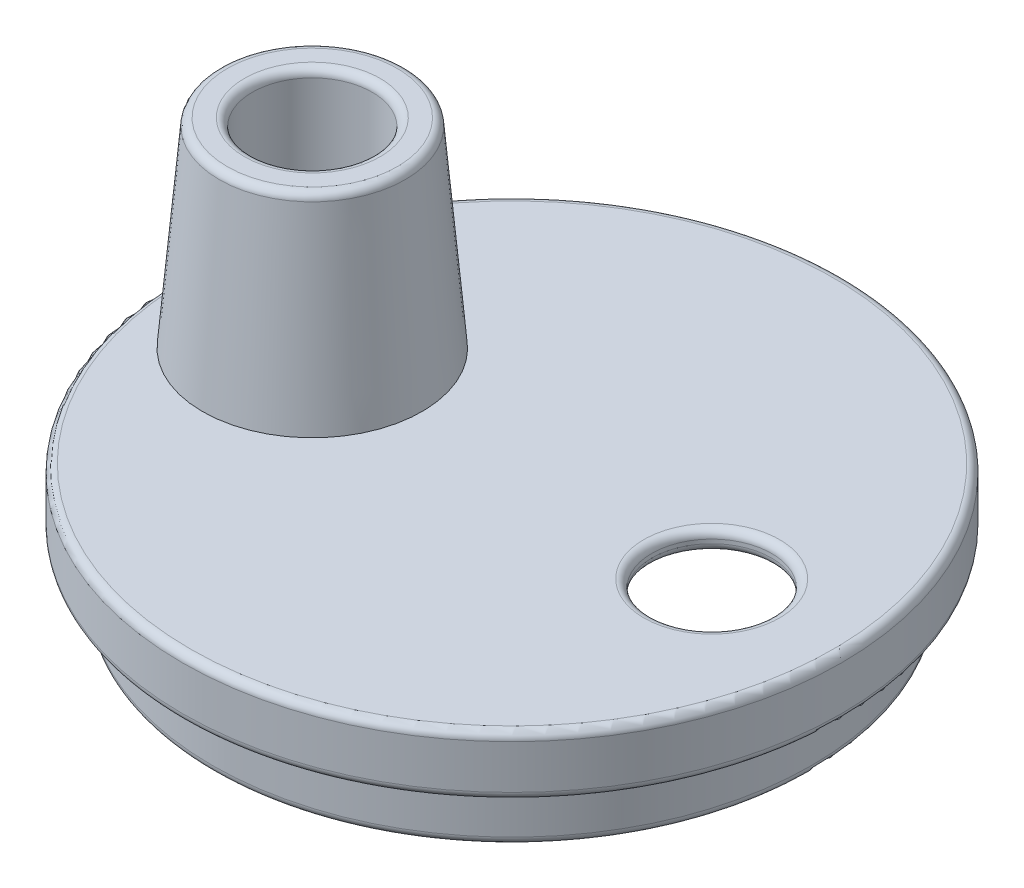
ISO-10303-21;
HEADER;
FILE_DESCRIPTION(('STEP AP214'),'2;1');
FILE_NAME('part.step','',(''),(''),'','','');
FILE_SCHEMA(('AUTOMOTIVE_DESIGN { 1 0 10303 214 1 1 1 1 }'));
ENDSEC;
DATA;
#1=APPLICATION_CONTEXT('core data for automotive mechanical design processes');
#2=APPLICATION_PROTOCOL_DEFINITION('international standard','automotive_design',2000,#1);
#3=PRODUCT_CONTEXT('',#1,'mechanical');
#4=PRODUCT('Part','Part','',(#3));
#5=PRODUCT_RELATED_PRODUCT_CATEGORY('part','',(#4));
#6=PRODUCT_DEFINITION_FORMATION('','',#4);
#7=PRODUCT_DEFINITION_CONTEXT('part definition',#1,'design');
#8=PRODUCT_DEFINITION('design','',#6,#7);
#9=PRODUCT_DEFINITION_SHAPE('','',#8);
#10=(LENGTH_UNIT() NAMED_UNIT(*) SI_UNIT(.MILLI.,.METRE.));
#11=(NAMED_UNIT(*) PLANE_ANGLE_UNIT() SI_UNIT($,.RADIAN.));
#12=(NAMED_UNIT(*) SI_UNIT($,.STERADIAN.) SOLID_ANGLE_UNIT());
#13=UNCERTAINTY_MEASURE_WITH_UNIT(LENGTH_MEASURE(1.E-05),#10,'distance_accuracy_value','');
#14=(GEOMETRIC_REPRESENTATION_CONTEXT(3) GLOBAL_UNCERTAINTY_ASSIGNED_CONTEXT((#13)) GLOBAL_UNIT_ASSIGNED_CONTEXT((#10,
#11,#12)) REPRESENTATION_CONTEXT('',''));
#15=CARTESIAN_POINT('',(0.,0.,0.));
#16=DIRECTION('',(0.,0.,1.));
#17=DIRECTION('',(1.,0.,0.));
#18=AXIS2_PLACEMENT_3D('',#15,#16,#17);
#19=CARTESIAN_POINT('',(0.,0.,0.));
#20=DIRECTION('',(0.,1.,0.));
#21=DIRECTION('',(0.,0.,1.));
#22=AXIS2_PLACEMENT_3D('',#19,#20,#21);
#23=PLANE('',#22);
#24=CARTESIAN_POINT('',(5.,0.,0.));
#25=DIRECTION('',(0.,1.,0.));
#26=DIRECTION('',(0.,0.,1.));
#27=AXIS2_PLACEMENT_3D('',#24,#25,#26);
#28=CIRCLE('',#27,1.7);
#29=CARTESIAN_POINT('',(5.,0.,1.7));
#30=VERTEX_POINT('',#29);
#31=EDGE_CURVE('E47',#30,#30,#28,.F.);
#32=ORIENTED_EDGE('',*,*,#31,.T.);
#33=EDGE_LOOP('',(#32));
#34=FACE_BOUND('',#33,.T.);
#35=CARTESIAN_POINT('',(0.,0.,0.));
#36=DIRECTION('',(0.,1.,0.));
#37=DIRECTION('',(0.,0.,1.));
#38=AXIS2_PLACEMENT_3D('',#35,#36,#37);
#39=CIRCLE('',#38,8.05);
#40=CARTESIAN_POINT('',(0.,0.,8.05));
#41=VERTEX_POINT('',#40);
#42=EDGE_CURVE('E52',#41,#41,#39,.T.);
#43=ORIENTED_EDGE('',*,*,#42,.T.);
#44=EDGE_LOOP('',(#43));
#45=FACE_BOUND('',#44,.T.);
#46=CARTESIAN_POINT('',(-5.,0.,0.));
#47=DIRECTION('',(0.,1.,0.));
#48=DIRECTION('',(0.,0.,1.));
#49=AXIS2_PLACEMENT_3D('',#46,#47,#48);
#50=CIRCLE('',#49,2.75);
#51=CARTESIAN_POINT('',(-5.,0.,2.75));
#52=VERTEX_POINT('',#51);
#53=EDGE_CURVE('E106',#52,#52,#50,.T.);
#54=ORIENTED_EDGE('',*,*,#53,.F.);
#55=EDGE_LOOP('',(#54));
#56=FACE_BOUND('',#55,.T.);
#57=ADVANCED_FACE('F32',(#34,#45,#56),#23,.T.);
#58=CARTESIAN_POINT('',(0.,0.,0.));
#59=DIRECTION('',(0.,1.,0.));
#60=DIRECTION('',(0.,0.,1.));
#61=AXIS2_PLACEMENT_3D('',#58,#59,#60);
#62=CYLINDRICAL_SURFACE('',#61,8.25);
#63=CARTESIAN_POINT('',(0.,-1.3,0.));
#64=DIRECTION('',(0.,-1.,0.));
#65=DIRECTION('',(0.,0.,-1.));
#66=AXIS2_PLACEMENT_3D('',#63,#64,#65);
#67=CIRCLE('',#66,8.25);
#68=CARTESIAN_POINT('',(0.,-1.3,-8.25));
#69=VERTEX_POINT('',#68);
#70=EDGE_CURVE('E64',#69,#69,#67,.F.);
#71=ORIENTED_EDGE('',*,*,#70,.T.);
#72=EDGE_LOOP('',(#71));
#73=FACE_BOUND('',#72,.T.);
#74=CARTESIAN_POINT('',(0.,-0.2,0.));
#75=DIRECTION('',(0.,1.,0.));
#76=DIRECTION('',(0.,0.,1.));
#77=AXIS2_PLACEMENT_3D('',#74,#75,#76);
#78=CIRCLE('',#77,8.25);
#79=CARTESIAN_POINT('',(0.,-0.200000000000001,8.25));
#80=VERTEX_POINT('',#79);
#81=EDGE_CURVE('E67',#80,#80,#78,.F.);
#82=ORIENTED_EDGE('',*,*,#81,.T.);
#83=EDGE_LOOP('',(#82));
#84=FACE_BOUND('',#83,.T.);
#85=ADVANCED_FACE('F113',(#73,#84),#62,.T.);
#86=CARTESIAN_POINT('',(0.,-1.5,8.25));
#87=DIRECTION('',(0.,-1.,0.));
#88=DIRECTION('',(0.,0.,-1.));
#89=AXIS2_PLACEMENT_3D('',#86,#87,#88);
#90=PLANE('',#89);
#91=CARTESIAN_POINT('',(0.,-1.5,0.));
#92=DIRECTION('',(0.,-1.,0.));
#93=DIRECTION('',(0.,0.,-1.));
#94=AXIS2_PLACEMENT_3D('',#91,#92,#93);
#95=CIRCLE('',#94,8.05);
#96=CARTESIAN_POINT('',(0.,-1.5,-8.05));
#97=VERTEX_POINT('',#96);
#98=EDGE_CURVE('E61',#97,#97,#95,.T.);
#99=ORIENTED_EDGE('',*,*,#98,.T.);
#100=EDGE_LOOP('',(#99));
#101=FACE_BOUND('',#100,.T.);
#102=CARTESIAN_POINT('',(0.,-1.5,0.));
#103=DIRECTION('',(0.,1.,0.));
#104=DIRECTION('',(0.,0.,1.));
#105=AXIS2_PLACEMENT_3D('',#102,#103,#104);
#106=CIRCLE('',#105,7.5);
#107=CARTESIAN_POINT('',(0.,-1.5,7.5));
#108=VERTEX_POINT('',#107);
#109=EDGE_CURVE('E94',#108,#108,#106,.T.);
#110=ORIENTED_EDGE('',*,*,#109,.T.);
#111=EDGE_LOOP('',(#110));
#112=FACE_BOUND('',#111,.T.);
#113=ADVANCED_FACE('F119',(#101,#112),#90,.T.);
#114=CARTESIAN_POINT('',(0.,0.,0.));
#115=DIRECTION('',(0.,1.,0.));
#116=DIRECTION('',(0.,0.,1.));
#117=AXIS2_PLACEMENT_3D('',#114,#115,#116);
#118=CYLINDRICAL_SURFACE('',#117,7.5);
#119=CARTESIAN_POINT('',(0.,-2.8,0.));
#120=DIRECTION('',(0.,-1.,0.));
#121=DIRECTION('',(0.,0.,-1.));
#122=AXIS2_PLACEMENT_3D('',#119,#120,#121);
#123=CIRCLE('',#122,7.5);
#124=CARTESIAN_POINT('',(0.,-2.8,-7.5));
#125=VERTEX_POINT('',#124);
#126=EDGE_CURVE('E70',#125,#125,#123,.F.);
#127=ORIENTED_EDGE('',*,*,#126,.T.);
#128=EDGE_LOOP('',(#127));
#129=FACE_BOUND('',#128,.T.);
#130=ORIENTED_EDGE('',*,*,#109,.F.);
#131=EDGE_LOOP('',(#130));
#132=FACE_BOUND('',#131,.T.);
#133=ADVANCED_FACE('F198',(#129,#132),#118,.T.);
#134=CARTESIAN_POINT('',(0.,-3.,7.));
#135=DIRECTION('',(0.,-1.,0.));
#136=DIRECTION('',(0.,0.,-1.));
#137=AXIS2_PLACEMENT_3D('',#134,#135,#136);
#138=PLANE('',#137);
#139=CARTESIAN_POINT('',(0.,-3.,0.));
#140=DIRECTION('',(0.,-1.,0.));
#141=DIRECTION('',(0.,0.,-1.));
#142=AXIS2_PLACEMENT_3D('',#139,#140,#141);
#143=CIRCLE('',#142,7.2);
#144=CARTESIAN_POINT('',(0.,-3.,-7.2));
#145=VERTEX_POINT('',#144);
#146=EDGE_CURVE('E76',#145,#145,#143,.F.);
#147=ORIENTED_EDGE('',*,*,#146,.T.);
#148=EDGE_LOOP('',(#147));
#149=FACE_BOUND('',#148,.T.);
#150=CARTESIAN_POINT('',(0.,-3.,0.));
#151=DIRECTION('',(0.,-1.,0.));
#152=DIRECTION('',(0.,0.,-1.));
#153=AXIS2_PLACEMENT_3D('',#150,#151,#152);
#154=CIRCLE('',#153,7.3);
#155=CARTESIAN_POINT('',(0.,-3.,-7.3));
#156=VERTEX_POINT('',#155);
#157=EDGE_CURVE('E79',#156,#156,#154,.T.);
#158=ORIENTED_EDGE('',*,*,#157,.T.);
#159=EDGE_LOOP('',(#158));
#160=FACE_BOUND('',#159,.T.);
#161=ADVANCED_FACE('F194',(#149,#160),#138,.T.);
#162=CARTESIAN_POINT('',(0.,0.,0.));
#163=DIRECTION('',(0.,1.,0.));
#164=DIRECTION('',(0.,0.,1.));
#165=AXIS2_PLACEMENT_3D('',#162,#163,#164);
#166=CYLINDRICAL_SURFACE('',#165,7.);
#167=CARTESIAN_POINT('',(0.,-2.8,0.));
#168=DIRECTION('',(0.,-1.,0.));
#169=DIRECTION('',(0.,0.,-1.));
#170=AXIS2_PLACEMENT_3D('',#167,#168,#169);
#171=CIRCLE('',#170,7.);
#172=CARTESIAN_POINT('',(0.,-2.8,-7.));
#173=VERTEX_POINT('',#172);
#174=EDGE_CURVE('E73',#173,#173,#171,.T.);
#175=ORIENTED_EDGE('',*,*,#174,.T.);
#176=EDGE_LOOP('',(#175));
#177=FACE_BOUND('',#176,.T.);
#178=CARTESIAN_POINT('',(0.,-1.,0.));
#179=DIRECTION('',(0.,1.,0.));
#180=DIRECTION('',(0.,0.,1.));
#181=AXIS2_PLACEMENT_3D('',#178,#179,#180);
#182=CIRCLE('',#181,7.);
#183=CARTESIAN_POINT('',(0.,-1.,7.));
#184=VERTEX_POINT('',#183);
#185=EDGE_CURVE('E97',#184,#184,#182,.T.);
#186=ORIENTED_EDGE('',*,*,#185,.T.);
#187=EDGE_LOOP('',(#186));
#188=FACE_BOUND('',#187,.T.);
#189=ADVANCED_FACE('F190',(#177,#188),#166,.F.);
#190=CARTESIAN_POINT('',(0.,-1.,7.75));
#191=DIRECTION('',(0.,1.,0.));
#192=DIRECTION('',(0.,0.,1.));
#193=AXIS2_PLACEMENT_3D('',#190,#191,#192);
#194=PLANE('',#193);
#195=CARTESIAN_POINT('',(0.,-1.,0.));
#196=DIRECTION('',(0.,1.,0.));
#197=DIRECTION('',(0.,0.,1.));
#198=AXIS2_PLACEMENT_3D('',#195,#196,#197);
#199=CIRCLE('',#198,7.75);
#200=CARTESIAN_POINT('',(0.,-1.,7.75));
#201=VERTEX_POINT('',#200);
#202=EDGE_CURVE('E100',#201,#201,#199,.T.);
#203=ORIENTED_EDGE('',*,*,#202,.T.);
#204=EDGE_LOOP('',(#203));
#205=FACE_BOUND('',#204,.T.);
#206=ORIENTED_EDGE('',*,*,#185,.F.);
#207=EDGE_LOOP('',(#206));
#208=FACE_BOUND('',#207,.T.);
#209=ADVANCED_FACE('F186',(#205,#208),#194,.T.);
#210=CARTESIAN_POINT('',(0.,0.,0.));
#211=DIRECTION('',(0.,1.,0.));
#212=DIRECTION('',(0.,0.,1.));
#213=AXIS2_PLACEMENT_3D('',#210,#211,#212);
#214=CYLINDRICAL_SURFACE('',#213,7.75);
#215=CARTESIAN_POINT('',(0.,-0.5,0.));
#216=DIRECTION('',(0.,1.,0.));
#217=DIRECTION('',(0.,0.,1.));
#218=AXIS2_PLACEMENT_3D('',#215,#216,#217);
#219=CIRCLE('',#218,7.75);
#220=CARTESIAN_POINT('',(0.,-0.500000000000001,7.75));
#221=VERTEX_POINT('',#220);
#222=EDGE_CURVE('E103',#221,#221,#219,.T.);
#223=ORIENTED_EDGE('',*,*,#222,.T.);
#224=EDGE_LOOP('',(#223));
#225=FACE_BOUND('',#224,.T.);
#226=ORIENTED_EDGE('',*,*,#202,.F.);
#227=EDGE_LOOP('',(#226));
#228=FACE_BOUND('',#227,.T.);
#229=ADVANCED_FACE('F182',(#225,#228),#214,.F.);
#230=CARTESIAN_POINT('',(0.,-0.5,0.));
#231=DIRECTION('',(0.,-1.,0.));
#232=DIRECTION('',(0.,0.,-1.));
#233=AXIS2_PLACEMENT_3D('',#230,#231,#232);
#234=PLANE('',#233);
#235=CARTESIAN_POINT('',(-5.,-0.5,0.));
#236=DIRECTION('',(0.,-1.,0.));
#237=DIRECTION('',(0.,0.,-1.));
#238=AXIS2_PLACEMENT_3D('',#235,#236,#237);
#239=CIRCLE('',#238,1.7);
#240=CARTESIAN_POINT('',(-5.,-0.5,-1.7));
#241=VERTEX_POINT('',#240);
#242=EDGE_CURVE('E88',#241,#241,#239,.F.);
#243=ORIENTED_EDGE('',*,*,#242,.T.);
#244=EDGE_LOOP('',(#243));
#245=FACE_BOUND('',#244,.T.);
#246=CARTESIAN_POINT('',(5.,-0.5,0.));
#247=DIRECTION('',(0.,-1.,0.));
#248=DIRECTION('',(0.,0.,-1.));
#249=AXIS2_PLACEMENT_3D('',#246,#247,#248);
#250=CIRCLE('',#249,1.7);
#251=CARTESIAN_POINT('',(5.,-0.5,-1.7));
#252=VERTEX_POINT('',#251);
#253=EDGE_CURVE('E91',#252,#252,#250,.F.);
#254=ORIENTED_EDGE('',*,*,#253,.T.);
#255=EDGE_LOOP('',(#254));
#256=FACE_BOUND('',#255,.T.);
#257=ORIENTED_EDGE('',*,*,#222,.F.);
#258=EDGE_LOOP('',(#257));
#259=FACE_BOUND('',#258,.T.);
#260=ADVANCED_FACE('F176',(#245,#256,#259),#234,.T.);
#261=CARTESIAN_POINT('',(5.,-3.001,0.));
#262=DIRECTION('',(0.,1.,0.));
#263=DIRECTION('',(0.,0.,1.));
#264=AXIS2_PLACEMENT_3D('',#261,#262,#263);
#265=CYLINDRICAL_SURFACE('',#264,1.5);
#266=CARTESIAN_POINT('',(5.,-0.299999999999999,0.));
#267=DIRECTION('',(0.,-1.,0.));
#268=DIRECTION('',(0.,0.,-1.));
#269=AXIS2_PLACEMENT_3D('',#266,#267,#268);
#270=CIRCLE('',#269,1.5);
#271=CARTESIAN_POINT('',(5.,-0.299999999999999,-1.5));
#272=VERTEX_POINT('',#271);
#273=EDGE_CURVE('E55',#272,#272,#270,.T.);
#274=ORIENTED_EDGE('',*,*,#273,.T.);
#275=EDGE_LOOP('',(#274));
#276=FACE_BOUND('',#275,.T.);
#277=CARTESIAN_POINT('',(5.,-0.2,0.));
#278=DIRECTION('',(0.,1.,0.));
#279=DIRECTION('',(0.,0.,1.));
#280=AXIS2_PLACEMENT_3D('',#277,#278,#279);
#281=CIRCLE('',#280,1.5);
#282=CARTESIAN_POINT('',(5.,-0.2,1.5));
#283=VERTEX_POINT('',#282);
#284=EDGE_CURVE('E58',#283,#283,#281,.T.);
#285=ORIENTED_EDGE('',*,*,#284,.T.);
#286=EDGE_LOOP('',(#285));
#287=FACE_BOUND('',#286,.T.);
#288=ADVANCED_FACE('F168',(#276,#287),#265,.F.);
#289=CARTESIAN_POINT('',(-5.,-3.001,0.));
#290=DIRECTION('',(0.,1.,0.));
#291=DIRECTION('',(0.,0.,1.));
#292=AXIS2_PLACEMENT_3D('',#289,#290,#291);
#293=CYLINDRICAL_SURFACE('',#292,1.5);
#294=CARTESIAN_POINT('',(-5.,-0.299999999999999,0.));
#295=DIRECTION('',(0.,-1.,0.));
#296=DIRECTION('',(0.,0.,-1.));
#297=AXIS2_PLACEMENT_3D('',#294,#295,#296);
#298=CIRCLE('',#297,1.5);
#299=CARTESIAN_POINT('',(-5.,-0.299999999999999,-1.5));
#300=VERTEX_POINT('',#299);
#301=EDGE_CURVE('E82',#300,#300,#298,.T.);
#302=ORIENTED_EDGE('',*,*,#301,.T.);
#303=EDGE_LOOP('',(#302));
#304=FACE_BOUND('',#303,.T.);
#305=CARTESIAN_POINT('',(-5.,4.8,0.));
#306=DIRECTION('',(0.,1.,0.));
#307=DIRECTION('',(0.,0.,1.));
#308=AXIS2_PLACEMENT_3D('',#305,#306,#307);
#309=CIRCLE('',#308,1.5);
#310=CARTESIAN_POINT('',(-5.,4.8,1.5));
#311=VERTEX_POINT('',#310);
#312=EDGE_CURVE('E85',#311,#311,#309,.T.);
#313=ORIENTED_EDGE('',*,*,#312,.T.);
#314=EDGE_LOOP('',(#313));
#315=FACE_BOUND('',#314,.T.);
#316=ADVANCED_FACE('F166',(#304,#315),#293,.F.);
#317=CARTESIAN_POINT('',(-5.,5.,0.));
#318=DIRECTION('',(0.,1.,0.));
#319=DIRECTION('',(0.,0.,1.));
#320=AXIS2_PLACEMENT_3D('',#317,#318,#319);
#321=PLANE('',#320);
#322=CARTESIAN_POINT('',(-5.,5.,0.));
#323=DIRECTION('',(0.,1.,0.));
#324=DIRECTION('',(0.,0.,1.));
#325=AXIS2_PLACEMENT_3D('',#322,#323,#324);
#326=CIRCLE('',#325,2.12929044756689);
#327=CARTESIAN_POINT('',(-5.,5.,2.1292904475669));
#328=VERTEX_POINT('',#327);
#329=EDGE_CURVE('E39',#328,#328,#326,.T.);
#330=ORIENTED_EDGE('',*,*,#329,.T.);
#331=EDGE_LOOP('',(#330));
#332=FACE_BOUND('',#331,.T.);
#333=CARTESIAN_POINT('',(-5.,5.,0.));
#334=DIRECTION('',(0.,1.,0.));
#335=DIRECTION('',(0.,0.,1.));
#336=AXIS2_PLACEMENT_3D('',#333,#334,#335);
#337=CIRCLE('',#336,1.7);
#338=CARTESIAN_POINT('',(-5.,5.,1.7));
#339=VERTEX_POINT('',#338);
#340=EDGE_CURVE('E43',#339,#339,#337,.F.);
#341=ORIENTED_EDGE('',*,*,#340,.T.);
#342=EDGE_LOOP('',(#341));
#343=FACE_BOUND('',#342,.T.);
#344=ADVANCED_FACE('F128',(#332,#343),#321,.T.);
#345=CARTESIAN_POINT('',(-5.,0.,0.));
#346=DIRECTION('',(0.,-1.,0.));
#347=DIRECTION('',(0.,0.,1.));
#348=AXIS2_PLACEMENT_3D('',#345,#346,#347);
#349=CONICAL_SURFACE('',#348,2.75,0.0872664625997165);
#350=CARTESIAN_POINT('',(-5.,4.81743114854953,0.));
#351=DIRECTION('',(0.,-1.,0.));
#352=DIRECTION('',(0.,0.,-1.));
#353=AXIS2_PLACEMENT_3D('',#350,#351,#352);
#354=CIRCLE('',#353,2.32852938718524);
#355=CARTESIAN_POINT('',(-5.,4.81743114854953,-2.32852938718524));
#356=VERTEX_POINT('',#355);
#357=EDGE_CURVE('E10',#356,#356,#354,.T.);
#358=ORIENTED_EDGE('',*,*,#357,.T.);
#359=EDGE_LOOP('',(#358));
#360=FACE_BOUND('',#359,.T.);
#361=ORIENTED_EDGE('',*,*,#53,.T.);
#362=EDGE_LOOP('',(#361));
#363=FACE_BOUND('',#362,.T.);
#364=ADVANCED_FACE('F110',(#360,#363),#349,.T.);
#365=CARTESIAN_POINT('',(-5.,-0.3,0.));
#366=DIRECTION('',(0.,-1.,0.));
#367=DIRECTION('',(0.,0.,-1.));
#368=AXIS2_PLACEMENT_3D('',#365,#366,#367);
#369=TOROIDAL_SURFACE('',#368,1.7,0.2);
#370=ORIENTED_EDGE('',*,*,#301,.F.);
#371=EDGE_LOOP('',(#370));
#372=FACE_BOUND('',#371,.T.);
#373=ORIENTED_EDGE('',*,*,#242,.F.);
#374=EDGE_LOOP('',(#373));
#375=FACE_BOUND('',#374,.T.);
#376=ADVANCED_FACE('F127',(#372,#375),#369,.T.);
#377=CARTESIAN_POINT('',(0.,-2.8,0.));
#378=DIRECTION('',(0.,-1.,0.));
#379=DIRECTION('',(0.,0.,-1.));
#380=AXIS2_PLACEMENT_3D('',#377,#378,#379);
#381=TOROIDAL_SURFACE('',#380,7.2,0.2);
#382=ORIENTED_EDGE('',*,*,#174,.F.);
#383=EDGE_LOOP('',(#382));
#384=FACE_BOUND('',#383,.T.);
#385=ORIENTED_EDGE('',*,*,#146,.F.);
#386=EDGE_LOOP('',(#385));
#387=FACE_BOUND('',#386,.T.);
#388=ADVANCED_FACE('F131',(#384,#387),#381,.T.);
#389=CARTESIAN_POINT('',(0.,-2.8,0.));
#390=DIRECTION('',(0.,-1.,0.));
#391=DIRECTION('',(0.,0.,-1.));
#392=AXIS2_PLACEMENT_3D('',#389,#390,#391);
#393=TOROIDAL_SURFACE('',#392,7.3,0.2);
#394=ORIENTED_EDGE('',*,*,#157,.F.);
#395=EDGE_LOOP('',(#394));
#396=FACE_BOUND('',#395,.T.);
#397=ORIENTED_EDGE('',*,*,#126,.F.);
#398=EDGE_LOOP('',(#397));
#399=FACE_BOUND('',#398,.T.);
#400=ADVANCED_FACE('F135',(#396,#399),#393,.T.);
#401=CARTESIAN_POINT('',(0.,-1.3,0.));
#402=DIRECTION('',(0.,-1.,0.));
#403=DIRECTION('',(0.,0.,-1.));
#404=AXIS2_PLACEMENT_3D('',#401,#402,#403);
#405=TOROIDAL_SURFACE('',#404,8.05,0.2);
#406=ORIENTED_EDGE('',*,*,#98,.F.);
#407=EDGE_LOOP('',(#406));
#408=FACE_BOUND('',#407,.T.);
#409=ORIENTED_EDGE('',*,*,#70,.F.);
#410=EDGE_LOOP('',(#409));
#411=FACE_BOUND('',#410,.T.);
#412=ADVANCED_FACE('F139',(#408,#411),#405,.T.);
#413=CARTESIAN_POINT('',(5.,-0.3,0.));
#414=DIRECTION('',(0.,-1.,0.));
#415=DIRECTION('',(0.,0.,-1.));
#416=AXIS2_PLACEMENT_3D('',#413,#414,#415);
#417=TOROIDAL_SURFACE('',#416,1.7,0.2);
#418=ORIENTED_EDGE('',*,*,#273,.F.);
#419=EDGE_LOOP('',(#418));
#420=FACE_BOUND('',#419,.T.);
#421=ORIENTED_EDGE('',*,*,#253,.F.);
#422=EDGE_LOOP('',(#421));
#423=FACE_BOUND('',#422,.T.);
#424=ADVANCED_FACE('F143',(#420,#423),#417,.T.);
#425=CARTESIAN_POINT('',(5.,-0.2,0.));
#426=DIRECTION('',(0.,1.,0.));
#427=DIRECTION('',(0.,0.,1.));
#428=AXIS2_PLACEMENT_3D('',#425,#426,#427);
#429=TOROIDAL_SURFACE('',#428,1.7,0.2);
#430=ORIENTED_EDGE('',*,*,#31,.F.);
#431=EDGE_LOOP('',(#430));
#432=FACE_BOUND('',#431,.T.);
#433=ORIENTED_EDGE('',*,*,#284,.F.);
#434=EDGE_LOOP('',(#433));
#435=FACE_BOUND('',#434,.T.);
#436=ADVANCED_FACE('F147',(#432,#435),#429,.T.);
#437=CARTESIAN_POINT('',(-5.,4.8,0.));
#438=DIRECTION('',(0.,1.,0.));
#439=DIRECTION('',(0.,0.,1.));
#440=AXIS2_PLACEMENT_3D('',#437,#438,#439);
#441=TOROIDAL_SURFACE('',#440,2.12929044756689,0.2);
#442=ORIENTED_EDGE('',*,*,#357,.F.);
#443=EDGE_LOOP('',(#442));
#444=FACE_BOUND('',#443,.T.);
#445=ORIENTED_EDGE('',*,*,#329,.F.);
#446=EDGE_LOOP('',(#445));
#447=FACE_BOUND('',#446,.T.);
#448=ADVANCED_FACE('F151',(#444,#447),#441,.T.);
#449=CARTESIAN_POINT('',(-5.,4.8,0.));
#450=DIRECTION('',(0.,1.,0.));
#451=DIRECTION('',(0.,0.,1.));
#452=AXIS2_PLACEMENT_3D('',#449,#450,#451);
#453=TOROIDAL_SURFACE('',#452,1.7,0.2);
#454=ORIENTED_EDGE('',*,*,#340,.F.);
#455=EDGE_LOOP('',(#454));
#456=FACE_BOUND('',#455,.T.);
#457=ORIENTED_EDGE('',*,*,#312,.F.);
#458=EDGE_LOOP('',(#457));
#459=FACE_BOUND('',#458,.T.);
#460=ADVANCED_FACE('F154',(#456,#459),#453,.T.);
#461=CARTESIAN_POINT('',(0.,-0.2,0.));
#462=DIRECTION('',(0.,1.,0.));
#463=DIRECTION('',(0.,0.,1.));
#464=AXIS2_PLACEMENT_3D('',#461,#462,#463);
#465=TOROIDAL_SURFACE('',#464,8.05,0.2);
#466=ORIENTED_EDGE('',*,*,#81,.F.);
#467=EDGE_LOOP('',(#466));
#468=FACE_BOUND('',#467,.T.);
#469=ORIENTED_EDGE('',*,*,#42,.F.);
#470=EDGE_LOOP('',(#469));
#471=FACE_BOUND('',#470,.T.);
#472=ADVANCED_FACE('F34',(#468,#471),#465,.T.);
#473=CLOSED_SHELL('',(#57,#85,#113,#133,#161,#189,#209,#229,#260,#288,#316,#344,#364,#376,#388,
#400,#412,#424,#436,#448,#460,#472));
#474=MANIFOLD_SOLID_BREP('B2',#473);
#475=ADVANCED_BREP_SHAPE_REPRESENTATION('',(#18,#474),#14);
#476=SHAPE_DEFINITION_REPRESENTATION(#9,#475);
ENDSEC;
END-ISO-10303-21;
